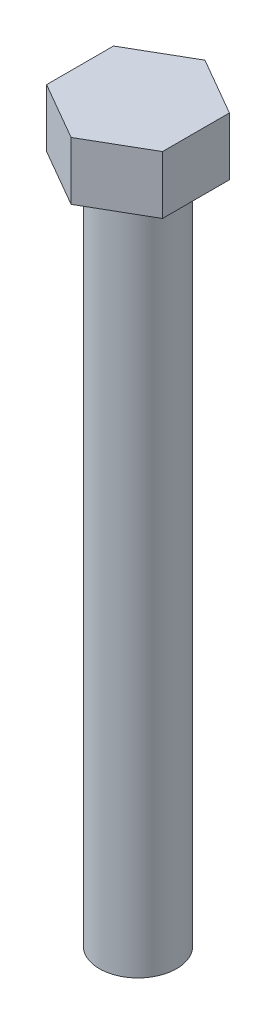
ISO-10303-21;
HEADER;
FILE_DESCRIPTION(('STEP AP214'),'2;1');
FILE_NAME('part.step','',(''),(''),'','','');
FILE_SCHEMA(('AUTOMOTIVE_DESIGN { 1 0 10303 214 1 1 1 1 }'));
ENDSEC;
DATA;
#1=APPLICATION_CONTEXT('core data for automotive mechanical design processes');
#2=APPLICATION_PROTOCOL_DEFINITION('international standard','automotive_design',2000,#1);
#3=PRODUCT_CONTEXT('',#1,'mechanical');
#4=PRODUCT('Part','Part','',(#3));
#5=PRODUCT_RELATED_PRODUCT_CATEGORY('part','',(#4));
#6=PRODUCT_DEFINITION_FORMATION('','',#4);
#7=PRODUCT_DEFINITION_CONTEXT('part definition',#1,'design');
#8=PRODUCT_DEFINITION('design','',#6,#7);
#9=PRODUCT_DEFINITION_SHAPE('','',#8);
#10=(LENGTH_UNIT() NAMED_UNIT(*) SI_UNIT(.MILLI.,.METRE.));
#11=(NAMED_UNIT(*) PLANE_ANGLE_UNIT() SI_UNIT($,.RADIAN.));
#12=(NAMED_UNIT(*) SI_UNIT($,.STERADIAN.) SOLID_ANGLE_UNIT());
#13=UNCERTAINTY_MEASURE_WITH_UNIT(LENGTH_MEASURE(1.E-05),#10,'distance_accuracy_value','');
#14=(GEOMETRIC_REPRESENTATION_CONTEXT(3) GLOBAL_UNCERTAINTY_ASSIGNED_CONTEXT((#13)) GLOBAL_UNIT_ASSIGNED_CONTEXT((#10,
#11,#12)) REPRESENTATION_CONTEXT('',''));
#15=CARTESIAN_POINT('',(0.,0.,0.));
#16=DIRECTION('',(0.,0.,1.));
#17=DIRECTION('',(1.,0.,0.));
#18=AXIS2_PLACEMENT_3D('',#15,#16,#17);
#19=CARTESIAN_POINT('',(-6.,6.,3.46410161513776));
#20=DIRECTION('',(0.5,0.,-0.866025403784439));
#21=DIRECTION('',(-0.866025403784439,0.,-0.5));
#22=AXIS2_PLACEMENT_3D('',#19,#20,#21);
#23=PLANE('',#22);
#24=DIRECTION('',(0.866025403784439,0.,0.5));
#25=VECTOR('',#24,1.);
#26=CARTESIAN_POINT('',(-6.,0.,3.46410161513776));
#27=LINE('',#26,#25);
#28=CARTESIAN_POINT('',(-6.,0.,3.46410161513776));
#29=VERTEX_POINT('',#28);
#30=CARTESIAN_POINT('',(0.,0.,6.92820323027551));
#31=VERTEX_POINT('',#30);
#32=EDGE_CURVE('E121',#29,#31,#27,.T.);
#33=ORIENTED_EDGE('',*,*,#32,.T.);
#34=DIRECTION('',(0.,-1.,0.));
#35=VECTOR('',#34,1.);
#36=CARTESIAN_POINT('',(0.,6.,6.92820323027551));
#37=LINE('',#36,#35);
#38=CARTESIAN_POINT('',(0.,6.,6.92820323027551));
#39=VERTEX_POINT('',#38);
#40=EDGE_CURVE('E38',#39,#31,#37,.T.);
#41=ORIENTED_EDGE('',*,*,#40,.F.);
#42=DIRECTION('',(0.866025403784439,0.,0.5));
#43=VECTOR('',#42,1.);
#44=CARTESIAN_POINT('',(-6.,6.,3.46410161513776));
#45=LINE('',#44,#43);
#46=CARTESIAN_POINT('',(-6.,6.,3.46410161513776));
#47=VERTEX_POINT('',#46);
#48=EDGE_CURVE('E132',#47,#39,#45,.T.);
#49=ORIENTED_EDGE('',*,*,#48,.F.);
#50=DIRECTION('',(0.,-1.,0.));
#51=VECTOR('',#50,1.);
#52=CARTESIAN_POINT('',(-6.,6.,3.46410161513776));
#53=LINE('',#52,#51);
#54=EDGE_CURVE('E117',#47,#29,#53,.T.);
#55=ORIENTED_EDGE('',*,*,#54,.T.);
#56=EDGE_LOOP('',(#33,#41,#49,#55));
#57=FACE_BOUND('',#56,.T.);
#58=ADVANCED_FACE('F35',(#57),#23,.F.);
#59=CARTESIAN_POINT('',(0.,6.,6.92820323027551));
#60=DIRECTION('',(-0.5,0.,-0.866025403784439));
#61=DIRECTION('',(-0.866025403784439,0.,0.5));
#62=AXIS2_PLACEMENT_3D('',#59,#60,#61);
#63=PLANE('',#62);
#64=DIRECTION('',(0.866025403784439,0.,-0.5));
#65=VECTOR('',#64,1.);
#66=CARTESIAN_POINT('',(0.,0.,6.92820323027551));
#67=LINE('',#66,#65);
#68=CARTESIAN_POINT('',(6.,0.,3.46410161513775));
#69=VERTEX_POINT('',#68);
#70=EDGE_CURVE('E124',#31,#69,#67,.T.);
#71=ORIENTED_EDGE('',*,*,#70,.T.);
#72=DIRECTION('',(0.,-1.,0.));
#73=VECTOR('',#72,1.);
#74=CARTESIAN_POINT('',(6.,6.,3.46410161513775));
#75=LINE('',#74,#73);
#76=CARTESIAN_POINT('',(6.,6.,3.46410161513775));
#77=VERTEX_POINT('',#76);
#78=EDGE_CURVE('E135',#77,#69,#75,.T.);
#79=ORIENTED_EDGE('',*,*,#78,.F.);
#80=DIRECTION('',(0.866025403784439,0.,-0.5));
#81=VECTOR('',#80,1.);
#82=CARTESIAN_POINT('',(0.,6.,6.92820323027551));
#83=LINE('',#82,#81);
#84=EDGE_CURVE('E90',#39,#77,#83,.T.);
#85=ORIENTED_EDGE('',*,*,#84,.F.);
#86=ORIENTED_EDGE('',*,*,#40,.T.);
#87=EDGE_LOOP('',(#71,#79,#85,#86));
#88=FACE_BOUND('',#87,.T.);
#89=ADVANCED_FACE('F140',(#88),#63,.F.);
#90=CARTESIAN_POINT('',(6.,6.,3.46410161513775));
#91=DIRECTION('',(-1.,0.,0.));
#92=DIRECTION('',(0.,0.,1.));
#93=AXIS2_PLACEMENT_3D('',#90,#91,#92);
#94=PLANE('',#93);
#95=DIRECTION('',(0.,0.,-1.));
#96=VECTOR('',#95,1.);
#97=CARTESIAN_POINT('',(6.,0.,3.46410161513775));
#98=LINE('',#97,#96);
#99=CARTESIAN_POINT('',(6.,0.,-3.46410161513776));
#100=VERTEX_POINT('',#99);
#101=EDGE_CURVE('E127',#69,#100,#98,.T.);
#102=ORIENTED_EDGE('',*,*,#101,.T.);
#103=DIRECTION('',(0.,-1.,0.));
#104=VECTOR('',#103,1.);
#105=CARTESIAN_POINT('',(6.,6.,-3.46410161513776));
#106=LINE('',#105,#104);
#107=CARTESIAN_POINT('',(6.,6.,-3.46410161513776));
#108=VERTEX_POINT('',#107);
#109=EDGE_CURVE('E112',#108,#100,#106,.T.);
#110=ORIENTED_EDGE('',*,*,#109,.F.);
#111=DIRECTION('',(0.,0.,-1.));
#112=VECTOR('',#111,1.);
#113=CARTESIAN_POINT('',(6.,6.,3.46410161513775));
#114=LINE('',#113,#112);
#115=EDGE_CURVE('E103',#77,#108,#114,.T.);
#116=ORIENTED_EDGE('',*,*,#115,.F.);
#117=ORIENTED_EDGE('',*,*,#78,.T.);
#118=EDGE_LOOP('',(#102,#110,#116,#117));
#119=FACE_BOUND('',#118,.T.);
#120=ADVANCED_FACE('F146',(#119),#94,.F.);
#121=CARTESIAN_POINT('',(6.,6.,-3.46410161513776));
#122=DIRECTION('',(-0.5,0.,0.866025403784439));
#123=DIRECTION('',(0.866025403784439,0.,0.5));
#124=AXIS2_PLACEMENT_3D('',#121,#122,#123);
#125=PLANE('',#124);
#126=DIRECTION('',(-0.866025403784439,0.,-0.5));
#127=VECTOR('',#126,1.);
#128=CARTESIAN_POINT('',(6.,0.,-3.46410161513776));
#129=LINE('',#128,#127);
#130=CARTESIAN_POINT('',(0.,0.,-6.92820323027551));
#131=VERTEX_POINT('',#130);
#132=EDGE_CURVE('E111',#100,#131,#129,.T.);
#133=ORIENTED_EDGE('',*,*,#132,.T.);
#134=DIRECTION('',(0.,-1.,0.));
#135=VECTOR('',#134,1.);
#136=CARTESIAN_POINT('',(0.,6.,-6.92820323027551));
#137=LINE('',#136,#135);
#138=CARTESIAN_POINT('',(0.,6.,-6.92820323027551));
#139=VERTEX_POINT('',#138);
#140=EDGE_CURVE('E108',#139,#131,#137,.T.);
#141=ORIENTED_EDGE('',*,*,#140,.F.);
#142=DIRECTION('',(-0.866025403784439,0.,-0.5));
#143=VECTOR('',#142,1.);
#144=CARTESIAN_POINT('',(6.,6.,-3.46410161513776));
#145=LINE('',#144,#143);
#146=EDGE_CURVE('E97',#108,#139,#145,.T.);
#147=ORIENTED_EDGE('',*,*,#146,.F.);
#148=ORIENTED_EDGE('',*,*,#109,.T.);
#149=EDGE_LOOP('',(#133,#141,#147,#148));
#150=FACE_BOUND('',#149,.T.);
#151=ADVANCED_FACE('F109',(#150),#125,.F.);
#152=CARTESIAN_POINT('',(0.,6.,-6.92820323027551));
#153=DIRECTION('',(0.5,0.,0.866025403784439));
#154=DIRECTION('',(0.866025403784439,0.,-0.5));
#155=AXIS2_PLACEMENT_3D('',#152,#153,#154);
#156=PLANE('',#155);
#157=DIRECTION('',(-0.866025403784439,0.,0.5));
#158=VECTOR('',#157,1.);
#159=CARTESIAN_POINT('',(0.,0.,-6.92820323027551));
#160=LINE('',#159,#158);
#161=CARTESIAN_POINT('',(-6.,0.,-3.46410161513776));
#162=VERTEX_POINT('',#161);
#163=EDGE_CURVE('E75',#131,#162,#160,.T.);
#164=ORIENTED_EDGE('',*,*,#163,.T.);
#165=DIRECTION('',(0.,-1.,0.));
#166=VECTOR('',#165,1.);
#167=CARTESIAN_POINT('',(-6.,6.,-3.46410161513776));
#168=LINE('',#167,#166);
#169=CARTESIAN_POINT('',(-6.,6.,-3.46410161513776));
#170=VERTEX_POINT('',#169);
#171=EDGE_CURVE('E113',#170,#162,#168,.T.);
#172=ORIENTED_EDGE('',*,*,#171,.F.);
#173=DIRECTION('',(-0.866025403784439,0.,0.5));
#174=VECTOR('',#173,1.);
#175=CARTESIAN_POINT('',(0.,6.,-6.92820323027551));
#176=LINE('',#175,#174);
#177=EDGE_CURVE('E101',#139,#170,#176,.T.);
#178=ORIENTED_EDGE('',*,*,#177,.F.);
#179=ORIENTED_EDGE('',*,*,#140,.T.);
#180=EDGE_LOOP('',(#164,#172,#178,#179));
#181=FACE_BOUND('',#180,.T.);
#182=ADVANCED_FACE('F115',(#181),#156,.F.);
#183=CARTESIAN_POINT('',(-6.,6.,-3.46410161513776));
#184=DIRECTION('',(1.,0.,0.));
#185=DIRECTION('',(0.,0.,-1.));
#186=AXIS2_PLACEMENT_3D('',#183,#184,#185);
#187=PLANE('',#186);
#188=DIRECTION('',(0.,0.,1.));
#189=VECTOR('',#188,1.);
#190=CARTESIAN_POINT('',(-6.,0.,-3.46410161513776));
#191=LINE('',#190,#189);
#192=EDGE_CURVE('E81',#162,#29,#191,.T.);
#193=ORIENTED_EDGE('',*,*,#192,.T.);
#194=ORIENTED_EDGE('',*,*,#54,.F.);
#195=DIRECTION('',(0.,0.,1.));
#196=VECTOR('',#195,1.);
#197=CARTESIAN_POINT('',(-6.,6.,-3.46410161513776));
#198=LINE('',#197,#196);
#199=EDGE_CURVE('E52',#170,#47,#198,.T.);
#200=ORIENTED_EDGE('',*,*,#199,.F.);
#201=ORIENTED_EDGE('',*,*,#171,.T.);
#202=EDGE_LOOP('',(#193,#194,#200,#201));
#203=FACE_BOUND('',#202,.T.);
#204=ADVANCED_FACE('F166',(#203),#187,.F.);
#205=CARTESIAN_POINT('',(0.,6.,0.));
#206=DIRECTION('',(0.,1.,0.));
#207=DIRECTION('',(0.,0.,1.));
#208=AXIS2_PLACEMENT_3D('',#205,#206,#207);
#209=PLANE('',#208);
#210=ORIENTED_EDGE('',*,*,#48,.T.);
#211=ORIENTED_EDGE('',*,*,#84,.T.);
#212=ORIENTED_EDGE('',*,*,#115,.T.);
#213=ORIENTED_EDGE('',*,*,#146,.T.);
#214=ORIENTED_EDGE('',*,*,#177,.T.);
#215=ORIENTED_EDGE('',*,*,#199,.T.);
#216=EDGE_LOOP('',(#210,#211,#212,#213,#214,#215));
#217=FACE_BOUND('',#216,.T.);
#218=ADVANCED_FACE('F99',(#217),#209,.T.);
#219=CARTESIAN_POINT('',(0.,0.,0.));
#220=DIRECTION('',(0.,1.,0.));
#221=DIRECTION('',(0.,0.,1.));
#222=AXIS2_PLACEMENT_3D('',#219,#220,#221);
#223=PLANE('',#222);
#224=CARTESIAN_POINT('',(0.,0.,0.));
#225=DIRECTION('',(0.,-1.,0.));
#226=DIRECTION('',(0.,0.,-1.));
#227=AXIS2_PLACEMENT_3D('',#224,#225,#226);
#228=CIRCLE('',#227,4.);
#229=CARTESIAN_POINT('',(0.,0.,-4.));
#230=VERTEX_POINT('',#229);
#231=EDGE_CURVE('E11',#230,#230,#228,.T.);
#232=ORIENTED_EDGE('',*,*,#231,.F.);
#233=EDGE_LOOP('',(#232));
#234=FACE_BOUND('',#233,.T.);
#235=ORIENTED_EDGE('',*,*,#32,.F.);
#236=ORIENTED_EDGE('',*,*,#192,.F.);
#237=ORIENTED_EDGE('',*,*,#163,.F.);
#238=ORIENTED_EDGE('',*,*,#132,.F.);
#239=ORIENTED_EDGE('',*,*,#101,.F.);
#240=ORIENTED_EDGE('',*,*,#70,.F.);
#241=EDGE_LOOP('',(#235,#236,#237,#238,#239,#240));
#242=FACE_BOUND('',#241,.T.);
#243=ADVANCED_FACE('F145',(#234,#242),#223,.F.);
#244=CARTESIAN_POINT('',(0.,-70.,0.));
#245=DIRECTION('',(0.,1.,0.));
#246=DIRECTION('',(0.,0.,1.));
#247=AXIS2_PLACEMENT_3D('',#244,#245,#246);
#248=CYLINDRICAL_SURFACE('',#247,4.);
#249=CARTESIAN_POINT('',(0.,-70.,0.));
#250=DIRECTION('',(0.,-1.,0.));
#251=DIRECTION('',(0.,0.,-1.));
#252=AXIS2_PLACEMENT_3D('',#249,#250,#251);
#253=CIRCLE('',#252,4.);
#254=CARTESIAN_POINT('',(0.,-70.,-4.));
#255=VERTEX_POINT('',#254);
#256=EDGE_CURVE('E125',#255,#255,#253,.T.);
#257=ORIENTED_EDGE('',*,*,#256,.F.);
#258=EDGE_LOOP('',(#257));
#259=FACE_BOUND('',#258,.T.);
#260=ORIENTED_EDGE('',*,*,#231,.T.);
#261=EDGE_LOOP('',(#260));
#262=FACE_BOUND('',#261,.T.);
#263=ADVANCED_FACE('F155',(#259,#262),#248,.T.);
#264=CARTESIAN_POINT('',(0.,-70.,0.));
#265=DIRECTION('',(0.,-1.,0.));
#266=DIRECTION('',(0.,0.,-1.));
#267=AXIS2_PLACEMENT_3D('',#264,#265,#266);
#268=PLANE('',#267);
#269=ORIENTED_EDGE('',*,*,#256,.T.);
#270=EDGE_LOOP('',(#269));
#271=FACE_BOUND('',#270,.T.);
#272=ADVANCED_FACE('F153',(#271),#268,.T.);
#273=CLOSED_SHELL('',(#58,#89,#120,#151,#182,#204,#218,#243,#263,#272));
#274=MANIFOLD_SOLID_BREP('B2',#273);
#275=ADVANCED_BREP_SHAPE_REPRESENTATION('',(#18,#274),#14);
#276=SHAPE_DEFINITION_REPRESENTATION(#9,#275);
ENDSEC;
END-ISO-10303-21;
